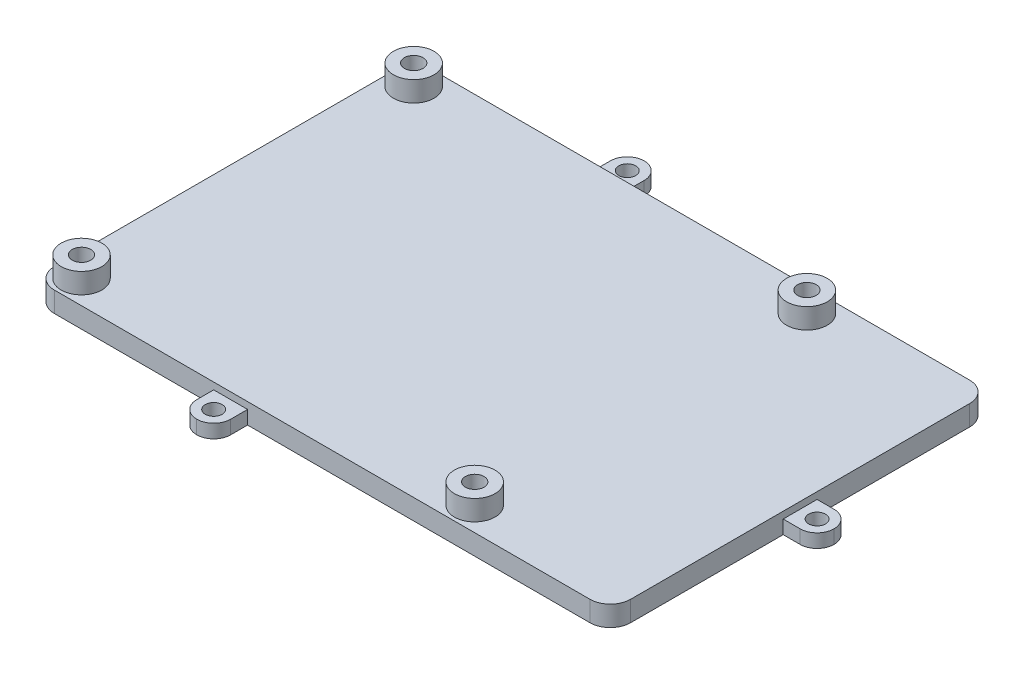
ISO-10303-21;
HEADER;
FILE_DESCRIPTION(('STEP AP214'),'2;1');
FILE_NAME('part.step','',(''),(''),'','','');
FILE_SCHEMA(('AUTOMOTIVE_DESIGN { 1 0 10303 214 1 1 1 1 }'));
ENDSEC;
DATA;
#1=APPLICATION_CONTEXT('core data for automotive mechanical design processes');
#2=APPLICATION_PROTOCOL_DEFINITION('international standard','automotive_design',2000,#1);
#3=PRODUCT_CONTEXT('',#1,'mechanical');
#4=PRODUCT('Part','Part','',(#3));
#5=PRODUCT_RELATED_PRODUCT_CATEGORY('part','',(#4));
#6=PRODUCT_DEFINITION_FORMATION('','',#4);
#7=PRODUCT_DEFINITION_CONTEXT('part definition',#1,'design');
#8=PRODUCT_DEFINITION('design','',#6,#7);
#9=PRODUCT_DEFINITION_SHAPE('','',#8);
#10=(LENGTH_UNIT() NAMED_UNIT(*) SI_UNIT(.MILLI.,.METRE.));
#11=(NAMED_UNIT(*) PLANE_ANGLE_UNIT() SI_UNIT($,.RADIAN.));
#12=(NAMED_UNIT(*) SI_UNIT($,.STERADIAN.) SOLID_ANGLE_UNIT());
#13=UNCERTAINTY_MEASURE_WITH_UNIT(LENGTH_MEASURE(1.E-05),#10,'distance_accuracy_value','');
#14=(GEOMETRIC_REPRESENTATION_CONTEXT(3) GLOBAL_UNCERTAINTY_ASSIGNED_CONTEXT((#13)) GLOBAL_UNIT_ASSIGNED_CONTEXT((#10,
#11,#12)) REPRESENTATION_CONTEXT('',''));
#15=CARTESIAN_POINT('',(0.,0.,0.));
#16=DIRECTION('',(0.,0.,1.));
#17=DIRECTION('',(1.,0.,0.));
#18=AXIS2_PLACEMENT_3D('',#15,#16,#17);
#19=CARTESIAN_POINT('',(0.,3.,0.));
#20=DIRECTION('',(0.,1.,0.));
#21=DIRECTION('',(0.,0.,1.));
#22=AXIS2_PLACEMENT_3D('',#19,#20,#21);
#23=PLANE('',#22);
#24=CARTESIAN_POINT('',(3.50000000000001,3.,-3.5));
#25=DIRECTION('',(0.,1.,0.));
#26=DIRECTION('',(0.,0.,1.));
#27=AXIS2_PLACEMENT_3D('',#24,#25,#26);
#28=CIRCLE('',#27,3.);
#29=CARTESIAN_POINT('',(3.50000000000001,3.,-0.5));
#30=VERTEX_POINT('',#29);
#31=EDGE_CURVE('E293',#30,#30,#28,.T.);
#32=ORIENTED_EDGE('',*,*,#31,.F.);
#33=EDGE_LOOP('',(#32));
#34=FACE_BOUND('',#33,.T.);
#35=CARTESIAN_POINT('',(3.50000000000001,3.,-52.5));
#36=DIRECTION('',(0.,1.,0.));
#37=DIRECTION('',(0.,0.,1.));
#38=AXIS2_PLACEMENT_3D('',#35,#36,#37);
#39=CIRCLE('',#38,3.);
#40=CARTESIAN_POINT('',(3.50000000000001,3.,-49.5));
#41=VERTEX_POINT('',#40);
#42=EDGE_CURVE('E311',#41,#41,#39,.T.);
#43=ORIENTED_EDGE('',*,*,#42,.F.);
#44=EDGE_LOOP('',(#43));
#45=FACE_BOUND('',#44,.T.);
#46=DIRECTION('',(-1.,0.,0.));
#47=VECTOR('',#46,1.);
#48=CARTESIAN_POINT('',(0.,3.,-56.));
#49=LINE('',#48,#47);
#50=CARTESIAN_POINT('',(82.,3.,-56.));
#51=VERTEX_POINT('',#50);
#52=CARTESIAN_POINT('',(3.,3.,-56.));
#53=VERTEX_POINT('',#52);
#54=EDGE_CURVE('E340',#51,#53,#49,.T.);
#55=ORIENTED_EDGE('',*,*,#54,.T.);
#56=CARTESIAN_POINT('',(3.,3.,-53.));
#57=DIRECTION('',(0.,1.,0.));
#58=DIRECTION('',(0.,0.,1.));
#59=AXIS2_PLACEMENT_3D('',#56,#57,#58);
#60=CIRCLE('',#59,3.);
#61=CARTESIAN_POINT('',(0.,3.,-53.));
#62=VERTEX_POINT('',#61);
#63=EDGE_CURVE('E376',#53,#62,#60,.T.);
#64=ORIENTED_EDGE('',*,*,#63,.T.);
#65=DIRECTION('',(0.,0.,1.));
#66=VECTOR('',#65,1.);
#67=CARTESIAN_POINT('',(0.,3.,-56.));
#68=LINE('',#67,#66);
#69=CARTESIAN_POINT('',(0.,3.,-3.));
#70=VERTEX_POINT('',#69);
#71=EDGE_CURVE('E330',#62,#70,#68,.T.);
#72=ORIENTED_EDGE('',*,*,#71,.T.);
#73=CARTESIAN_POINT('',(3.,3.,-3.));
#74=DIRECTION('',(0.,1.,0.));
#75=DIRECTION('',(0.,0.,1.));
#76=AXIS2_PLACEMENT_3D('',#73,#74,#75);
#77=CIRCLE('',#76,3.);
#78=CARTESIAN_POINT('',(3.,3.,0.));
#79=VERTEX_POINT('',#78);
#80=EDGE_CURVE('E370',#70,#79,#77,.T.);
#81=ORIENTED_EDGE('',*,*,#80,.T.);
#82=DIRECTION('',(1.,0.,0.));
#83=VECTOR('',#82,1.);
#84=CARTESIAN_POINT('',(0.,3.,0.));
#85=LINE('',#84,#83);
#86=CARTESIAN_POINT('',(82.,3.,0.));
#87=VERTEX_POINT('',#86);
#88=EDGE_CURVE('E333',#79,#87,#85,.T.);
#89=ORIENTED_EDGE('',*,*,#88,.T.);
#90=CARTESIAN_POINT('',(82.,3.,-3.));
#91=DIRECTION('',(0.,1.,0.));
#92=DIRECTION('',(0.,0.,1.));
#93=AXIS2_PLACEMENT_3D('',#90,#91,#92);
#94=CIRCLE('',#93,3.);
#95=CARTESIAN_POINT('',(85.,3.,-3.00000000000002));
#96=VERTEX_POINT('',#95);
#97=EDGE_CURVE('E372',#87,#96,#94,.T.);
#98=ORIENTED_EDGE('',*,*,#97,.T.);
#99=DIRECTION('',(0.,0.,-1.));
#100=VECTOR('',#99,1.);
#101=CARTESIAN_POINT('',(85.,3.,-56.));
#102=LINE('',#101,#100);
#103=CARTESIAN_POINT('',(85.,3.,-53.));
#104=VERTEX_POINT('',#103);
#105=EDGE_CURVE('E337',#96,#104,#102,.T.);
#106=ORIENTED_EDGE('',*,*,#105,.T.);
#107=CARTESIAN_POINT('',(82.,3.,-53.));
#108=DIRECTION('',(0.,1.,0.));
#109=DIRECTION('',(0.,0.,1.));
#110=AXIS2_PLACEMENT_3D('',#107,#108,#109);
#111=CIRCLE('',#110,3.);
#112=EDGE_CURVE('E374',#104,#51,#111,.T.);
#113=ORIENTED_EDGE('',*,*,#112,.T.);
#114=EDGE_LOOP('',(#55,#64,#72,#81,#89,#98,#106,#113));
#115=FACE_BOUND('',#114,.T.);
#116=CARTESIAN_POINT('',(61.5,3.,-52.5));
#117=DIRECTION('',(0.,1.,0.));
#118=DIRECTION('',(0.,0.,1.));
#119=AXIS2_PLACEMENT_3D('',#116,#117,#118);
#120=CIRCLE('',#119,3.00000000000001);
#121=CARTESIAN_POINT('',(61.5,3.,-49.5));
#122=VERTEX_POINT('',#121);
#123=EDGE_CURVE('E302',#122,#122,#120,.T.);
#124=ORIENTED_EDGE('',*,*,#123,.F.);
#125=EDGE_LOOP('',(#124));
#126=FACE_BOUND('',#125,.T.);
#127=CARTESIAN_POINT('',(61.5,3.,-3.5));
#128=DIRECTION('',(0.,1.,0.));
#129=DIRECTION('',(0.,0.,1.));
#130=AXIS2_PLACEMENT_3D('',#127,#128,#129);
#131=CIRCLE('',#130,3.00000000000001);
#132=CARTESIAN_POINT('',(61.5,3.,-0.499999999999992));
#133=VERTEX_POINT('',#132);
#134=EDGE_CURVE('E284',#133,#133,#131,.T.);
#135=ORIENTED_EDGE('',*,*,#134,.F.);
#136=EDGE_LOOP('',(#135));
#137=FACE_BOUND('',#136,.T.);
#138=ADVANCED_FACE('F34',(#34,#45,#115,#126,#137),#23,.T.);
#139=CARTESIAN_POINT('',(0.,0.,0.));
#140=DIRECTION('',(0.,1.,0.));
#141=DIRECTION('',(0.,0.,1.));
#142=AXIS2_PLACEMENT_3D('',#139,#140,#141);
#143=PLANE('',#142);
#144=DIRECTION('',(1.,0.,0.));
#145=VECTOR('',#144,1.);
#146=CARTESIAN_POINT('',(85.,0.,-30.5));
#147=LINE('',#146,#145);
#148=CARTESIAN_POINT('',(85.,0.,-30.5));
#149=VERTEX_POINT('',#148);
#150=CARTESIAN_POINT('',(87.5,0.,-30.5));
#151=VERTEX_POINT('',#150);
#152=EDGE_CURVE('E194',#149,#151,#147,.T.);
#153=ORIENTED_EDGE('',*,*,#152,.T.);
#154=CARTESIAN_POINT('',(87.5,0.,-28.));
#155=DIRECTION('',(0.,1.,0.));
#156=DIRECTION('',(0.,0.,1.));
#157=AXIS2_PLACEMENT_3D('',#154,#155,#156);
#158=CIRCLE('',#157,2.5);
#159=CARTESIAN_POINT('',(90.,0.,-28.));
#160=VERTEX_POINT('',#159);
#161=EDGE_CURVE('E421',#151,#160,#158,.F.);
#162=ORIENTED_EDGE('',*,*,#161,.T.);
#163=CARTESIAN_POINT('',(87.5,0.,-28.));
#164=DIRECTION('',(0.,1.,0.));
#165=DIRECTION('',(0.,0.,1.));
#166=AXIS2_PLACEMENT_3D('',#163,#164,#165);
#167=CIRCLE('',#166,2.5);
#168=CARTESIAN_POINT('',(87.5,0.,-25.5));
#169=VERTEX_POINT('',#168);
#170=EDGE_CURVE('E419',#160,#169,#167,.F.);
#171=ORIENTED_EDGE('',*,*,#170,.T.);
#172=DIRECTION('',(-1.,0.,0.));
#173=VECTOR('',#172,1.);
#174=CARTESIAN_POINT('',(85.,0.,-25.5));
#175=LINE('',#174,#173);
#176=CARTESIAN_POINT('',(85.,0.,-25.5));
#177=VERTEX_POINT('',#176);
#178=EDGE_CURVE('E219',#169,#177,#175,.T.);
#179=ORIENTED_EDGE('',*,*,#178,.T.);
#180=DIRECTION('',(0.,0.,-1.));
#181=VECTOR('',#180,1.);
#182=CARTESIAN_POINT('',(85.,0.,-56.));
#183=LINE('',#182,#181);
#184=CARTESIAN_POINT('',(85.,0.,-3.00000000000002));
#185=VERTEX_POINT('',#184);
#186=EDGE_CURVE('E199',#185,#177,#183,.T.);
#187=ORIENTED_EDGE('',*,*,#186,.F.);
#188=CARTESIAN_POINT('',(82.,0.,-3.));
#189=DIRECTION('',(0.,1.,0.));
#190=DIRECTION('',(0.,0.,1.));
#191=AXIS2_PLACEMENT_3D('',#188,#189,#190);
#192=CIRCLE('',#191,3.);
#193=CARTESIAN_POINT('',(82.,0.,0.));
#194=VERTEX_POINT('',#193);
#195=EDGE_CURVE('E358',#185,#194,#192,.F.);
#196=ORIENTED_EDGE('',*,*,#195,.T.);
#197=DIRECTION('',(1.,0.,0.));
#198=VECTOR('',#197,1.);
#199=CARTESIAN_POINT('',(0.,0.,0.));
#200=LINE('',#199,#198);
#201=CARTESIAN_POINT('',(31.5,0.,0.));
#202=VERTEX_POINT('',#201);
#203=EDGE_CURVE('E346',#202,#194,#200,.T.);
#204=ORIENTED_EDGE('',*,*,#203,.F.);
#205=DIRECTION('',(0.,0.,1.));
#206=VECTOR('',#205,1.);
#207=CARTESIAN_POINT('',(31.5,0.,0.));
#208=LINE('',#207,#206);
#209=CARTESIAN_POINT('',(31.5,0.,2.5));
#210=VERTEX_POINT('',#209);
#211=EDGE_CURVE('E267',#202,#210,#208,.T.);
#212=ORIENTED_EDGE('',*,*,#211,.T.);
#213=CARTESIAN_POINT('',(29.,0.,2.5));
#214=DIRECTION('',(0.,1.,0.));
#215=DIRECTION('',(0.,0.,1.));
#216=AXIS2_PLACEMENT_3D('',#213,#214,#215);
#217=CIRCLE('',#216,2.5);
#218=CARTESIAN_POINT('',(29.,0.,5.));
#219=VERTEX_POINT('',#218);
#220=EDGE_CURVE('E388',#210,#219,#217,.F.);
#221=ORIENTED_EDGE('',*,*,#220,.T.);
#222=CARTESIAN_POINT('',(29.,0.,2.5));
#223=DIRECTION('',(0.,1.,0.));
#224=DIRECTION('',(0.,0.,1.));
#225=AXIS2_PLACEMENT_3D('',#222,#223,#224);
#226=CIRCLE('',#225,2.5);
#227=CARTESIAN_POINT('',(26.5,0.,2.5));
#228=VERTEX_POINT('',#227);
#229=EDGE_CURVE('E390',#219,#228,#226,.F.);
#230=ORIENTED_EDGE('',*,*,#229,.T.);
#231=DIRECTION('',(0.,0.,-1.));
#232=VECTOR('',#231,1.);
#233=CARTESIAN_POINT('',(26.5,0.,0.));
#234=LINE('',#233,#232);
#235=CARTESIAN_POINT('',(26.5,0.,0.));
#236=VERTEX_POINT('',#235);
#237=EDGE_CURVE('E260',#228,#236,#234,.T.);
#238=ORIENTED_EDGE('',*,*,#237,.T.);
#239=CARTESIAN_POINT('',(3.,0.,0.));
#240=VERTEX_POINT('',#239);
#241=EDGE_CURVE('E200',#240,#236,#200,.T.);
#242=ORIENTED_EDGE('',*,*,#241,.F.);
#243=CARTESIAN_POINT('',(3.,0.,-3.));
#244=DIRECTION('',(0.,1.,0.));
#245=DIRECTION('',(0.,0.,1.));
#246=AXIS2_PLACEMENT_3D('',#243,#244,#245);
#247=CIRCLE('',#246,3.);
#248=CARTESIAN_POINT('',(0.,0.,-3.));
#249=VERTEX_POINT('',#248);
#250=EDGE_CURVE('E356',#240,#249,#247,.F.);
#251=ORIENTED_EDGE('',*,*,#250,.T.);
#252=DIRECTION('',(0.,0.,1.));
#253=VECTOR('',#252,1.);
#254=CARTESIAN_POINT('',(0.,0.,-56.));
#255=LINE('',#254,#253);
#256=CARTESIAN_POINT('',(0.,0.,-53.));
#257=VERTEX_POINT('',#256);
#258=EDGE_CURVE('E329',#257,#249,#255,.T.);
#259=ORIENTED_EDGE('',*,*,#258,.F.);
#260=CARTESIAN_POINT('',(3.,0.,-53.));
#261=DIRECTION('',(0.,1.,0.));
#262=DIRECTION('',(0.,0.,1.));
#263=AXIS2_PLACEMENT_3D('',#260,#261,#262);
#264=CIRCLE('',#263,3.);
#265=CARTESIAN_POINT('',(3.,0.,-56.));
#266=VERTEX_POINT('',#265);
#267=EDGE_CURVE('E362',#257,#266,#264,.F.);
#268=ORIENTED_EDGE('',*,*,#267,.T.);
#269=DIRECTION('',(-1.,0.,0.));
#270=VECTOR('',#269,1.);
#271=CARTESIAN_POINT('',(0.,0.,-56.));
#272=LINE('',#271,#270);
#273=CARTESIAN_POINT('',(26.5,0.,-56.));
#274=VERTEX_POINT('',#273);
#275=EDGE_CURVE('E349',#274,#266,#272,.T.);
#276=ORIENTED_EDGE('',*,*,#275,.F.);
#277=DIRECTION('',(0.,0.,-1.));
#278=VECTOR('',#277,1.);
#279=CARTESIAN_POINT('',(26.5,0.,-56.));
#280=LINE('',#279,#278);
#281=CARTESIAN_POINT('',(26.5,0.,-58.5));
#282=VERTEX_POINT('',#281);
#283=EDGE_CURVE('E235',#274,#282,#280,.T.);
#284=ORIENTED_EDGE('',*,*,#283,.T.);
#285=CARTESIAN_POINT('',(29.,0.,-58.5));
#286=DIRECTION('',(0.,1.,0.));
#287=DIRECTION('',(0.,0.,1.));
#288=AXIS2_PLACEMENT_3D('',#285,#286,#287);
#289=CIRCLE('',#288,2.5);
#290=CARTESIAN_POINT('',(29.,0.,-61.));
#291=VERTEX_POINT('',#290);
#292=EDGE_CURVE('E401',#282,#291,#289,.F.);
#293=ORIENTED_EDGE('',*,*,#292,.T.);
#294=CARTESIAN_POINT('',(29.,0.,-58.5));
#295=DIRECTION('',(0.,1.,0.));
#296=DIRECTION('',(0.,0.,1.));
#297=AXIS2_PLACEMENT_3D('',#294,#295,#296);
#298=CIRCLE('',#297,2.5);
#299=CARTESIAN_POINT('',(31.5,0.,-58.5));
#300=VERTEX_POINT('',#299);
#301=EDGE_CURVE('E405',#291,#300,#298,.F.);
#302=ORIENTED_EDGE('',*,*,#301,.T.);
#303=DIRECTION('',(0.,0.,1.));
#304=VECTOR('',#303,1.);
#305=CARTESIAN_POINT('',(31.5,0.,-56.));
#306=LINE('',#305,#304);
#307=CARTESIAN_POINT('',(31.5,0.,-56.));
#308=VERTEX_POINT('',#307);
#309=EDGE_CURVE('E243',#300,#308,#306,.T.);
#310=ORIENTED_EDGE('',*,*,#309,.T.);
#311=CARTESIAN_POINT('',(82.,0.,-56.));
#312=VERTEX_POINT('',#311);
#313=EDGE_CURVE('E334',#312,#308,#272,.T.);
#314=ORIENTED_EDGE('',*,*,#313,.F.);
#315=CARTESIAN_POINT('',(82.,0.,-53.));
#316=DIRECTION('',(0.,1.,0.));
#317=DIRECTION('',(0.,0.,1.));
#318=AXIS2_PLACEMENT_3D('',#315,#316,#317);
#319=CIRCLE('',#318,3.);
#320=CARTESIAN_POINT('',(85.,0.,-53.));
#321=VERTEX_POINT('',#320);
#322=EDGE_CURVE('E196',#312,#321,#319,.F.);
#323=ORIENTED_EDGE('',*,*,#322,.T.);
#324=EDGE_CURVE('E189',#149,#321,#183,.T.);
#325=ORIENTED_EDGE('',*,*,#324,.F.);
#326=EDGE_LOOP('',(#153,#162,#171,#179,#187,#196,#204,#212,#221,#230,#238,#242,#251,#259,#268,
#276,#284,#293,#302,#310,#314,#323,#325));
#327=FACE_BOUND('',#326,.T.);
#328=CARTESIAN_POINT('',(61.5,0.,-52.5));
#329=DIRECTION('',(0.,1.,0.));
#330=DIRECTION('',(0.,0.,1.));
#331=AXIS2_PLACEMENT_3D('',#328,#329,#330);
#332=CIRCLE('',#331,1.375);
#333=CARTESIAN_POINT('',(61.5,0.,-51.125));
#334=VERTEX_POINT('',#333);
#335=EDGE_CURVE('E326',#334,#334,#332,.T.);
#336=ORIENTED_EDGE('',*,*,#335,.T.);
#337=EDGE_LOOP('',(#336));
#338=FACE_BOUND('',#337,.T.);
#339=CARTESIAN_POINT('',(3.50000000000001,0.,-52.5));
#340=DIRECTION('',(0.,1.,0.));
#341=DIRECTION('',(0.,0.,1.));
#342=AXIS2_PLACEMENT_3D('',#339,#340,#341);
#343=CIRCLE('',#342,1.375);
#344=CARTESIAN_POINT('',(3.50000000000001,0.,-51.125));
#345=VERTEX_POINT('',#344);
#346=EDGE_CURVE('E323',#345,#345,#343,.T.);
#347=ORIENTED_EDGE('',*,*,#346,.T.);
#348=EDGE_LOOP('',(#347));
#349=FACE_BOUND('',#348,.T.);
#350=CARTESIAN_POINT('',(3.50000000000001,0.,-3.5));
#351=DIRECTION('',(0.,1.,0.));
#352=DIRECTION('',(0.,0.,1.));
#353=AXIS2_PLACEMENT_3D('',#350,#351,#352);
#354=CIRCLE('',#353,1.375);
#355=CARTESIAN_POINT('',(3.50000000000001,0.,-2.125));
#356=VERTEX_POINT('',#355);
#357=EDGE_CURVE('E320',#356,#356,#354,.T.);
#358=ORIENTED_EDGE('',*,*,#357,.T.);
#359=EDGE_LOOP('',(#358));
#360=FACE_BOUND('',#359,.T.);
#361=CARTESIAN_POINT('',(61.5,0.,-3.5));
#362=DIRECTION('',(0.,1.,0.));
#363=DIRECTION('',(0.,0.,1.));
#364=AXIS2_PLACEMENT_3D('',#361,#362,#363);
#365=CIRCLE('',#364,1.375);
#366=CARTESIAN_POINT('',(61.5,0.,-2.125));
#367=VERTEX_POINT('',#366);
#368=EDGE_CURVE('E315',#367,#367,#365,.T.);
#369=ORIENTED_EDGE('',*,*,#368,.T.);
#370=EDGE_LOOP('',(#369));
#371=FACE_BOUND('',#370,.T.);
#372=CARTESIAN_POINT('',(29.,0.,2.5));
#373=DIRECTION('',(0.,-1.,0.));
#374=DIRECTION('',(0.,0.,-1.));
#375=AXIS2_PLACEMENT_3D('',#372,#373,#374);
#376=CIRCLE('',#375,1.25);
#377=CARTESIAN_POINT('',(29.,0.,1.25));
#378=VERTEX_POINT('',#377);
#379=EDGE_CURVE('E261',#378,#378,#376,.T.);
#380=ORIENTED_EDGE('',*,*,#379,.F.);
#381=EDGE_LOOP('',(#380));
#382=FACE_BOUND('',#381,.T.);
#383=CARTESIAN_POINT('',(29.,0.,-58.5));
#384=DIRECTION('',(0.,-1.,0.));
#385=DIRECTION('',(0.,0.,-1.));
#386=AXIS2_PLACEMENT_3D('',#383,#384,#385);
#387=CIRCLE('',#386,1.25);
#388=CARTESIAN_POINT('',(29.,0.,-59.75));
#389=VERTEX_POINT('',#388);
#390=EDGE_CURVE('E236',#389,#389,#387,.T.);
#391=ORIENTED_EDGE('',*,*,#390,.F.);
#392=EDGE_LOOP('',(#391));
#393=FACE_BOUND('',#392,.T.);
#394=CARTESIAN_POINT('',(87.5,0.,-28.));
#395=DIRECTION('',(0.,-1.,0.));
#396=DIRECTION('',(0.,0.,-1.));
#397=AXIS2_PLACEMENT_3D('',#394,#395,#396);
#398=CIRCLE('',#397,1.25);
#399=CARTESIAN_POINT('',(87.5,0.,-29.25));
#400=VERTEX_POINT('',#399);
#401=EDGE_CURVE('E224',#400,#400,#398,.T.);
#402=ORIENTED_EDGE('',*,*,#401,.F.);
#403=EDGE_LOOP('',(#402));
#404=FACE_BOUND('',#403,.T.);
#405=ADVANCED_FACE('F191',(#327,#338,#349,#360,#371,#382,#393,#404),#143,.F.);
#406=CARTESIAN_POINT('',(0.,3.,-56.));
#407=DIRECTION('',(1.,0.,0.));
#408=DIRECTION('',(0.,0.,-1.));
#409=AXIS2_PLACEMENT_3D('',#406,#407,#408);
#410=PLANE('',#409);
#411=ORIENTED_EDGE('',*,*,#71,.F.);
#412=DIRECTION('',(0.,-1.,0.));
#413=VECTOR('',#412,1.);
#414=CARTESIAN_POINT('',(0.,3.,-53.));
#415=LINE('',#414,#413);
#416=EDGE_CURVE('E353',#62,#257,#415,.T.);
#417=ORIENTED_EDGE('',*,*,#416,.T.);
#418=ORIENTED_EDGE('',*,*,#258,.T.);
#419=DIRECTION('',(0.,-1.,0.));
#420=VECTOR('',#419,1.);
#421=CARTESIAN_POINT('',(0.,3.,-3.));
#422=LINE('',#421,#420);
#423=EDGE_CURVE('E343',#249,#70,#422,.F.);
#424=ORIENTED_EDGE('',*,*,#423,.T.);
#425=EDGE_LOOP('',(#411,#417,#418,#424));
#426=FACE_BOUND('',#425,.T.);
#427=ADVANCED_FACE('F440',(#426),#410,.F.);
#428=CARTESIAN_POINT('',(0.,3.,0.));
#429=DIRECTION('',(0.,0.,-1.));
#430=DIRECTION('',(-1.,0.,0.));
#431=AXIS2_PLACEMENT_3D('',#428,#429,#430);
#432=PLANE('',#431);
#433=ORIENTED_EDGE('',*,*,#241,.T.);
#434=DIRECTION('',(0.,-1.,0.));
#435=VECTOR('',#434,1.);
#436=CARTESIAN_POINT('',(26.5,2.,0.));
#437=LINE('',#436,#435);
#438=CARTESIAN_POINT('',(26.5,2.,0.));
#439=VERTEX_POINT('',#438);
#440=EDGE_CURVE('E272',#439,#236,#437,.T.);
#441=ORIENTED_EDGE('',*,*,#440,.F.);
#442=DIRECTION('',(1.,0.,0.));
#443=VECTOR('',#442,1.);
#444=CARTESIAN_POINT('',(26.5,2.,0.));
#445=LINE('',#444,#443);
#446=CARTESIAN_POINT('',(31.5,2.,0.));
#447=VERTEX_POINT('',#446);
#448=EDGE_CURVE('E266',#439,#447,#445,.T.);
#449=ORIENTED_EDGE('',*,*,#448,.T.);
#450=DIRECTION('',(0.,-1.,0.));
#451=VECTOR('',#450,1.);
#452=CARTESIAN_POINT('',(31.5,2.,0.));
#453=LINE('',#452,#451);
#454=EDGE_CURVE('E276',#447,#202,#453,.T.);
#455=ORIENTED_EDGE('',*,*,#454,.T.);
#456=ORIENTED_EDGE('',*,*,#203,.T.);
#457=DIRECTION('',(0.,-1.,0.));
#458=VECTOR('',#457,1.);
#459=CARTESIAN_POINT('',(82.,3.,0.));
#460=LINE('',#459,#458);
#461=EDGE_CURVE('E386',#194,#87,#460,.F.);
#462=ORIENTED_EDGE('',*,*,#461,.T.);
#463=ORIENTED_EDGE('',*,*,#88,.F.);
#464=DIRECTION('',(0.,-1.,0.));
#465=VECTOR('',#464,1.);
#466=CARTESIAN_POINT('',(3.,3.,0.));
#467=LINE('',#466,#465);
#468=EDGE_CURVE('E383',#79,#240,#467,.T.);
#469=ORIENTED_EDGE('',*,*,#468,.T.);
#470=EDGE_LOOP('',(#433,#441,#449,#455,#456,#462,#463,#469));
#471=FACE_BOUND('',#470,.T.);
#472=ADVANCED_FACE('F446',(#471),#432,.F.);
#473=CARTESIAN_POINT('',(85.,3.,-56.));
#474=DIRECTION('',(-1.,0.,0.));
#475=DIRECTION('',(0.,0.,1.));
#476=AXIS2_PLACEMENT_3D('',#473,#474,#475);
#477=PLANE('',#476);
#478=ORIENTED_EDGE('',*,*,#186,.T.);
#479=DIRECTION('',(0.,-1.,0.));
#480=VECTOR('',#479,1.);
#481=CARTESIAN_POINT('',(85.,2.,-25.5));
#482=LINE('',#481,#480);
#483=CARTESIAN_POINT('',(85.,2.,-25.5));
#484=VERTEX_POINT('',#483);
#485=EDGE_CURVE('E212',#484,#177,#482,.T.);
#486=ORIENTED_EDGE('',*,*,#485,.F.);
#487=DIRECTION('',(0.,0.,-1.));
#488=VECTOR('',#487,1.);
#489=CARTESIAN_POINT('',(85.,2.,-25.5));
#490=LINE('',#489,#488);
#491=CARTESIAN_POINT('',(85.,2.,-30.5));
#492=VERTEX_POINT('',#491);
#493=EDGE_CURVE('E208',#484,#492,#490,.T.);
#494=ORIENTED_EDGE('',*,*,#493,.T.);
#495=DIRECTION('',(0.,-1.,0.));
#496=VECTOR('',#495,1.);
#497=CARTESIAN_POINT('',(85.,2.,-30.5));
#498=LINE('',#497,#496);
#499=EDGE_CURVE('E203',#492,#149,#498,.T.);
#500=ORIENTED_EDGE('',*,*,#499,.T.);
#501=ORIENTED_EDGE('',*,*,#324,.T.);
#502=DIRECTION('',(0.,-1.,0.));
#503=VECTOR('',#502,1.);
#504=CARTESIAN_POINT('',(85.,3.,-53.));
#505=LINE('',#504,#503);
#506=EDGE_CURVE('E381',#321,#104,#505,.F.);
#507=ORIENTED_EDGE('',*,*,#506,.T.);
#508=ORIENTED_EDGE('',*,*,#105,.F.);
#509=DIRECTION('',(0.,-1.,0.));
#510=VECTOR('',#509,1.);
#511=CARTESIAN_POINT('',(85.,3.,-3.));
#512=LINE('',#511,#510);
#513=EDGE_CURVE('E378',#96,#185,#512,.T.);
#514=ORIENTED_EDGE('',*,*,#513,.T.);
#515=EDGE_LOOP('',(#478,#486,#494,#500,#501,#507,#508,#514));
#516=FACE_BOUND('',#515,.T.);
#517=ADVANCED_FACE('F205',(#516),#477,.F.);
#518=CARTESIAN_POINT('',(0.,3.,-56.));
#519=DIRECTION('',(0.,0.,1.));
#520=DIRECTION('',(1.,0.,0.));
#521=AXIS2_PLACEMENT_3D('',#518,#519,#520);
#522=PLANE('',#521);
#523=DIRECTION('',(-1.,0.,0.));
#524=VECTOR('',#523,1.);
#525=CARTESIAN_POINT('',(26.5,2.,-56.));
#526=LINE('',#525,#524);
#527=CARTESIAN_POINT('',(31.5,2.,-56.));
#528=VERTEX_POINT('',#527);
#529=CARTESIAN_POINT('',(26.5,2.,-56.));
#530=VERTEX_POINT('',#529);
#531=EDGE_CURVE('E245',#528,#530,#526,.T.);
#532=ORIENTED_EDGE('',*,*,#531,.T.);
#533=DIRECTION('',(0.,-1.,0.));
#534=VECTOR('',#533,1.);
#535=CARTESIAN_POINT('',(26.5,2.,-56.));
#536=LINE('',#535,#534);
#537=EDGE_CURVE('E251',#530,#274,#536,.T.);
#538=ORIENTED_EDGE('',*,*,#537,.T.);
#539=ORIENTED_EDGE('',*,*,#275,.T.);
#540=DIRECTION('',(0.,-1.,0.));
#541=VECTOR('',#540,1.);
#542=CARTESIAN_POINT('',(3.,3.,-56.));
#543=LINE('',#542,#541);
#544=EDGE_CURVE('E368',#266,#53,#543,.F.);
#545=ORIENTED_EDGE('',*,*,#544,.T.);
#546=ORIENTED_EDGE('',*,*,#54,.F.);
#547=DIRECTION('',(0.,-1.,0.));
#548=VECTOR('',#547,1.);
#549=CARTESIAN_POINT('',(82.,3.,-56.));
#550=LINE('',#549,#548);
#551=EDGE_CURVE('E365',#51,#312,#550,.T.);
#552=ORIENTED_EDGE('',*,*,#551,.T.);
#553=ORIENTED_EDGE('',*,*,#313,.T.);
#554=DIRECTION('',(0.,-1.,0.));
#555=VECTOR('',#554,1.);
#556=CARTESIAN_POINT('',(31.5,2.,-56.));
#557=LINE('',#556,#555);
#558=EDGE_CURVE('E247',#528,#308,#557,.T.);
#559=ORIENTED_EDGE('',*,*,#558,.F.);
#560=EDGE_LOOP('',(#532,#538,#539,#545,#546,#552,#553,#559));
#561=FACE_BOUND('',#560,.T.);
#562=ADVANCED_FACE('F453',(#561),#522,.F.);
#563=CARTESIAN_POINT('',(61.5,3.,-52.5));
#564=DIRECTION('',(0.,-1.,0.));
#565=DIRECTION('',(0.,0.,-1.));
#566=AXIS2_PLACEMENT_3D('',#563,#564,#565);
#567=CYLINDRICAL_SURFACE('',#566,1.375);
#568=ORIENTED_EDGE('',*,*,#335,.F.);
#569=EDGE_LOOP('',(#568));
#570=FACE_BOUND('',#569,.T.);
#571=CARTESIAN_POINT('',(61.5,6.,-52.5));
#572=DIRECTION('',(0.,1.,0.));
#573=DIRECTION('',(0.,0.,1.));
#574=AXIS2_PLACEMENT_3D('',#571,#572,#573);
#575=CIRCLE('',#574,1.375);
#576=CARTESIAN_POINT('',(61.5,6.,-51.125));
#577=VERTEX_POINT('',#576);
#578=EDGE_CURVE('E297',#577,#577,#575,.T.);
#579=ORIENTED_EDGE('',*,*,#578,.T.);
#580=EDGE_LOOP('',(#579));
#581=FACE_BOUND('',#580,.T.);
#582=ADVANCED_FACE('F456',(#570,#581),#567,.F.);
#583=CARTESIAN_POINT('',(3.50000000000001,3.,-52.5));
#584=DIRECTION('',(0.,-1.,0.));
#585=DIRECTION('',(0.,0.,-1.));
#586=AXIS2_PLACEMENT_3D('',#583,#584,#585);
#587=CYLINDRICAL_SURFACE('',#586,1.375);
#588=ORIENTED_EDGE('',*,*,#346,.F.);
#589=EDGE_LOOP('',(#588));
#590=FACE_BOUND('',#589,.T.);
#591=CARTESIAN_POINT('',(3.50000000000001,6.,-52.5));
#592=DIRECTION('',(0.,1.,0.));
#593=DIRECTION('',(0.,0.,1.));
#594=AXIS2_PLACEMENT_3D('',#591,#592,#593);
#595=CIRCLE('',#594,1.375);
#596=CARTESIAN_POINT('',(3.50000000000001,6.,-51.125));
#597=VERTEX_POINT('',#596);
#598=EDGE_CURVE('E306',#597,#597,#595,.T.);
#599=ORIENTED_EDGE('',*,*,#598,.T.);
#600=EDGE_LOOP('',(#599));
#601=FACE_BOUND('',#600,.T.);
#602=ADVANCED_FACE('F586',(#590,#601),#587,.F.);
#603=CARTESIAN_POINT('',(3.50000000000001,3.,-3.5));
#604=DIRECTION('',(0.,-1.,0.));
#605=DIRECTION('',(0.,0.,-1.));
#606=AXIS2_PLACEMENT_3D('',#603,#604,#605);
#607=CYLINDRICAL_SURFACE('',#606,1.375);
#608=ORIENTED_EDGE('',*,*,#357,.F.);
#609=EDGE_LOOP('',(#608));
#610=FACE_BOUND('',#609,.T.);
#611=CARTESIAN_POINT('',(3.50000000000001,6.,-3.5));
#612=DIRECTION('',(0.,1.,0.));
#613=DIRECTION('',(0.,0.,1.));
#614=AXIS2_PLACEMENT_3D('',#611,#612,#613);
#615=CIRCLE('',#614,1.375);
#616=CARTESIAN_POINT('',(3.50000000000001,6.,-2.125));
#617=VERTEX_POINT('',#616);
#618=EDGE_CURVE('E288',#617,#617,#615,.T.);
#619=ORIENTED_EDGE('',*,*,#618,.T.);
#620=EDGE_LOOP('',(#619));
#621=FACE_BOUND('',#620,.T.);
#622=ADVANCED_FACE('F582',(#610,#621),#607,.F.);
#623=CARTESIAN_POINT('',(61.5,3.,-3.5));
#624=DIRECTION('',(0.,-1.,0.));
#625=DIRECTION('',(0.,0.,-1.));
#626=AXIS2_PLACEMENT_3D('',#623,#624,#625);
#627=CYLINDRICAL_SURFACE('',#626,1.375);
#628=ORIENTED_EDGE('',*,*,#368,.F.);
#629=EDGE_LOOP('',(#628));
#630=FACE_BOUND('',#629,.T.);
#631=CARTESIAN_POINT('',(61.5,6.,-3.5));
#632=DIRECTION('',(0.,1.,0.));
#633=DIRECTION('',(0.,0.,1.));
#634=AXIS2_PLACEMENT_3D('',#631,#632,#633);
#635=CIRCLE('',#634,1.375);
#636=CARTESIAN_POINT('',(61.5,6.,-2.125));
#637=VERTEX_POINT('',#636);
#638=EDGE_CURVE('E279',#637,#637,#635,.T.);
#639=ORIENTED_EDGE('',*,*,#638,.T.);
#640=EDGE_LOOP('',(#639));
#641=FACE_BOUND('',#640,.T.);
#642=ADVANCED_FACE('F467',(#630,#641),#627,.F.);
#643=CARTESIAN_POINT('',(3.,3.,-53.));
#644=DIRECTION('',(0.,-1.,0.));
#645=DIRECTION('',(0.,0.,-1.));
#646=AXIS2_PLACEMENT_3D('',#643,#644,#645);
#647=CYLINDRICAL_SURFACE('',#646,3.);
#648=ORIENTED_EDGE('',*,*,#63,.F.);
#649=ORIENTED_EDGE('',*,*,#544,.F.);
#650=ORIENTED_EDGE('',*,*,#267,.F.);
#651=ORIENTED_EDGE('',*,*,#416,.F.);
#652=EDGE_LOOP('',(#648,#649,#650,#651));
#653=FACE_BOUND('',#652,.T.);
#654=ADVANCED_FACE('F463',(#653),#647,.T.);
#655=CARTESIAN_POINT('',(82.,3.,-53.));
#656=DIRECTION('',(0.,-1.,0.));
#657=DIRECTION('',(0.,0.,-1.));
#658=AXIS2_PLACEMENT_3D('',#655,#656,#657);
#659=CYLINDRICAL_SURFACE('',#658,3.);
#660=ORIENTED_EDGE('',*,*,#112,.F.);
#661=ORIENTED_EDGE('',*,*,#506,.F.);
#662=ORIENTED_EDGE('',*,*,#322,.F.);
#663=ORIENTED_EDGE('',*,*,#551,.F.);
#664=EDGE_LOOP('',(#660,#661,#662,#663));
#665=FACE_BOUND('',#664,.T.);
#666=ADVANCED_FACE('F466',(#665),#659,.T.);
#667=CARTESIAN_POINT('',(82.,3.,-3.));
#668=DIRECTION('',(0.,-1.,0.));
#669=DIRECTION('',(0.,0.,-1.));
#670=AXIS2_PLACEMENT_3D('',#667,#668,#669);
#671=CYLINDRICAL_SURFACE('',#670,3.);
#672=ORIENTED_EDGE('',*,*,#97,.F.);
#673=ORIENTED_EDGE('',*,*,#461,.F.);
#674=ORIENTED_EDGE('',*,*,#195,.F.);
#675=ORIENTED_EDGE('',*,*,#513,.F.);
#676=EDGE_LOOP('',(#672,#673,#674,#675));
#677=FACE_BOUND('',#676,.T.);
#678=ADVANCED_FACE('F471',(#677),#671,.T.);
#679=CARTESIAN_POINT('',(3.,3.,-3.));
#680=DIRECTION('',(0.,-1.,0.));
#681=DIRECTION('',(0.,0.,-1.));
#682=AXIS2_PLACEMENT_3D('',#679,#680,#681);
#683=CYLINDRICAL_SURFACE('',#682,3.);
#684=ORIENTED_EDGE('',*,*,#80,.F.);
#685=ORIENTED_EDGE('',*,*,#423,.F.);
#686=ORIENTED_EDGE('',*,*,#250,.F.);
#687=ORIENTED_EDGE('',*,*,#468,.F.);
#688=EDGE_LOOP('',(#684,#685,#686,#687));
#689=FACE_BOUND('',#688,.T.);
#690=ADVANCED_FACE('F475',(#689),#683,.T.);
#691=CARTESIAN_POINT('',(3.50000000000001,6.,-52.5));
#692=DIRECTION('',(0.,1.,0.));
#693=DIRECTION('',(0.,0.,1.));
#694=AXIS2_PLACEMENT_3D('',#691,#692,#693);
#695=PLANE('',#694);
#696=CARTESIAN_POINT('',(3.50000000000001,6.,-52.5));
#697=DIRECTION('',(0.,1.,0.));
#698=DIRECTION('',(0.,0.,1.));
#699=AXIS2_PLACEMENT_3D('',#696,#697,#698);
#700=CIRCLE('',#699,3.);
#701=CARTESIAN_POINT('',(3.50000000000001,6.,-49.5));
#702=VERTEX_POINT('',#701);
#703=EDGE_CURVE('E312',#702,#702,#700,.T.);
#704=ORIENTED_EDGE('',*,*,#703,.T.);
#705=EDGE_LOOP('',(#704));
#706=FACE_BOUND('',#705,.T.);
#707=ORIENTED_EDGE('',*,*,#598,.F.);
#708=EDGE_LOOP('',(#707));
#709=FACE_BOUND('',#708,.T.);
#710=ADVANCED_FACE('F479',(#706,#709),#695,.T.);
#711=CARTESIAN_POINT('',(3.50000000000001,6.,-52.5));
#712=DIRECTION('',(0.,-1.,0.));
#713=DIRECTION('',(0.,0.,-1.));
#714=AXIS2_PLACEMENT_3D('',#711,#712,#713);
#715=CYLINDRICAL_SURFACE('',#714,3.);
#716=ORIENTED_EDGE('',*,*,#703,.F.);
#717=EDGE_LOOP('',(#716));
#718=FACE_BOUND('',#717,.T.);
#719=ORIENTED_EDGE('',*,*,#42,.T.);
#720=EDGE_LOOP('',(#719));
#721=FACE_BOUND('',#720,.T.);
#722=ADVANCED_FACE('F569',(#718,#721),#715,.T.);
#723=CARTESIAN_POINT('',(61.5,6.,-52.5));
#724=DIRECTION('',(0.,1.,0.));
#725=DIRECTION('',(0.,0.,1.));
#726=AXIS2_PLACEMENT_3D('',#723,#724,#725);
#727=PLANE('',#726);
#728=CARTESIAN_POINT('',(61.5,6.,-52.5));
#729=DIRECTION('',(0.,1.,0.));
#730=DIRECTION('',(0.,0.,1.));
#731=AXIS2_PLACEMENT_3D('',#728,#729,#730);
#732=CIRCLE('',#731,3.00000000000001);
#733=CARTESIAN_POINT('',(61.5,6.,-49.5));
#734=VERTEX_POINT('',#733);
#735=EDGE_CURVE('E303',#734,#734,#732,.T.);
#736=ORIENTED_EDGE('',*,*,#735,.T.);
#737=EDGE_LOOP('',(#736));
#738=FACE_BOUND('',#737,.T.);
#739=ORIENTED_EDGE('',*,*,#578,.F.);
#740=EDGE_LOOP('',(#739));
#741=FACE_BOUND('',#740,.T.);
#742=ADVANCED_FACE('F566',(#738,#741),#727,.T.);
#743=CARTESIAN_POINT('',(61.5,6.,-52.5));
#744=DIRECTION('',(0.,-1.,0.));
#745=DIRECTION('',(0.,0.,-1.));
#746=AXIS2_PLACEMENT_3D('',#743,#744,#745);
#747=CYLINDRICAL_SURFACE('',#746,3.00000000000001);
#748=ORIENTED_EDGE('',*,*,#735,.F.);
#749=EDGE_LOOP('',(#748));
#750=FACE_BOUND('',#749,.T.);
#751=ORIENTED_EDGE('',*,*,#123,.T.);
#752=EDGE_LOOP('',(#751));
#753=FACE_BOUND('',#752,.T.);
#754=ADVANCED_FACE('F561',(#750,#753),#747,.T.);
#755=CARTESIAN_POINT('',(3.50000000000001,6.,-3.5));
#756=DIRECTION('',(0.,1.,0.));
#757=DIRECTION('',(0.,0.,1.));
#758=AXIS2_PLACEMENT_3D('',#755,#756,#757);
#759=PLANE('',#758);
#760=CARTESIAN_POINT('',(3.50000000000001,6.,-3.5));
#761=DIRECTION('',(0.,1.,0.));
#762=DIRECTION('',(0.,0.,1.));
#763=AXIS2_PLACEMENT_3D('',#760,#761,#762);
#764=CIRCLE('',#763,3.);
#765=CARTESIAN_POINT('',(3.50000000000001,6.,-0.5));
#766=VERTEX_POINT('',#765);
#767=EDGE_CURVE('E294',#766,#766,#764,.T.);
#768=ORIENTED_EDGE('',*,*,#767,.T.);
#769=EDGE_LOOP('',(#768));
#770=FACE_BOUND('',#769,.T.);
#771=ORIENTED_EDGE('',*,*,#618,.F.);
#772=EDGE_LOOP('',(#771));
#773=FACE_BOUND('',#772,.T.);
#774=ADVANCED_FACE('F558',(#770,#773),#759,.T.);
#775=CARTESIAN_POINT('',(3.50000000000001,6.,-3.5));
#776=DIRECTION('',(0.,-1.,0.));
#777=DIRECTION('',(0.,0.,-1.));
#778=AXIS2_PLACEMENT_3D('',#775,#776,#777);
#779=CYLINDRICAL_SURFACE('',#778,3.);
#780=ORIENTED_EDGE('',*,*,#767,.F.);
#781=EDGE_LOOP('',(#780));
#782=FACE_BOUND('',#781,.T.);
#783=ORIENTED_EDGE('',*,*,#31,.T.);
#784=EDGE_LOOP('',(#783));
#785=FACE_BOUND('',#784,.T.);
#786=ADVANCED_FACE('F553',(#782,#785),#779,.T.);
#787=CARTESIAN_POINT('',(61.5,6.,-3.5));
#788=DIRECTION('',(0.,1.,0.));
#789=DIRECTION('',(0.,0.,1.));
#790=AXIS2_PLACEMENT_3D('',#787,#788,#789);
#791=PLANE('',#790);
#792=CARTESIAN_POINT('',(61.5,6.,-3.5));
#793=DIRECTION('',(0.,1.,0.));
#794=DIRECTION('',(0.,0.,1.));
#795=AXIS2_PLACEMENT_3D('',#792,#793,#794);
#796=CIRCLE('',#795,3.00000000000001);
#797=CARTESIAN_POINT('',(61.5,6.,-0.499999999999992));
#798=VERTEX_POINT('',#797);
#799=EDGE_CURVE('E285',#798,#798,#796,.T.);
#800=ORIENTED_EDGE('',*,*,#799,.T.);
#801=EDGE_LOOP('',(#800));
#802=FACE_BOUND('',#801,.T.);
#803=ORIENTED_EDGE('',*,*,#638,.F.);
#804=EDGE_LOOP('',(#803));
#805=FACE_BOUND('',#804,.T.);
#806=ADVANCED_FACE('F550',(#802,#805),#791,.T.);
#807=CARTESIAN_POINT('',(61.5,6.,-3.5));
#808=DIRECTION('',(0.,-1.,0.));
#809=DIRECTION('',(0.,0.,-1.));
#810=AXIS2_PLACEMENT_3D('',#807,#808,#809);
#811=CYLINDRICAL_SURFACE('',#810,3.00000000000001);
#812=ORIENTED_EDGE('',*,*,#799,.F.);
#813=EDGE_LOOP('',(#812));
#814=FACE_BOUND('',#813,.T.);
#815=ORIENTED_EDGE('',*,*,#134,.T.);
#816=EDGE_LOOP('',(#815));
#817=FACE_BOUND('',#816,.T.);
#818=ADVANCED_FACE('F548',(#814,#817),#811,.T.);
#819=CARTESIAN_POINT('',(26.5,2.,0.));
#820=DIRECTION('',(-1.,0.,0.));
#821=DIRECTION('',(0.,0.,1.));
#822=AXIS2_PLACEMENT_3D('',#819,#820,#821);
#823=PLANE('',#822);
#824=ORIENTED_EDGE('',*,*,#237,.F.);
#825=DIRECTION('',(0.,-1.,0.));
#826=VECTOR('',#825,1.);
#827=CARTESIAN_POINT('',(26.5,2.,2.5));
#828=LINE('',#827,#826);
#829=CARTESIAN_POINT('',(26.5,2.,2.5));
#830=VERTEX_POINT('',#829);
#831=EDGE_CURVE('E392',#228,#830,#828,.F.);
#832=ORIENTED_EDGE('',*,*,#831,.T.);
#833=DIRECTION('',(0.,0.,-1.));
#834=VECTOR('',#833,1.);
#835=CARTESIAN_POINT('',(26.5,2.,0.));
#836=LINE('',#835,#834);
#837=EDGE_CURVE('E264',#830,#439,#836,.T.);
#838=ORIENTED_EDGE('',*,*,#837,.T.);
#839=ORIENTED_EDGE('',*,*,#440,.T.);
#840=EDGE_LOOP('',(#824,#832,#838,#839));
#841=FACE_BOUND('',#840,.T.);
#842=ADVANCED_FACE('F544',(#841),#823,.T.);
#843=CARTESIAN_POINT('',(31.5,2.,0.));
#844=DIRECTION('',(1.,0.,0.));
#845=DIRECTION('',(0.,0.,-1.));
#846=AXIS2_PLACEMENT_3D('',#843,#844,#845);
#847=PLANE('',#846);
#848=DIRECTION('',(0.,0.,1.));
#849=VECTOR('',#848,1.);
#850=CARTESIAN_POINT('',(31.5,2.,0.));
#851=LINE('',#850,#849);
#852=CARTESIAN_POINT('',(31.5,2.,2.5));
#853=VERTEX_POINT('',#852);
#854=EDGE_CURVE('E269',#447,#853,#851,.T.);
#855=ORIENTED_EDGE('',*,*,#854,.T.);
#856=DIRECTION('',(0.,-1.,0.));
#857=VECTOR('',#856,1.);
#858=CARTESIAN_POINT('',(31.5,2.,2.5));
#859=LINE('',#858,#857);
#860=EDGE_CURVE('E399',#853,#210,#859,.T.);
#861=ORIENTED_EDGE('',*,*,#860,.T.);
#862=ORIENTED_EDGE('',*,*,#211,.F.);
#863=ORIENTED_EDGE('',*,*,#454,.F.);
#864=EDGE_LOOP('',(#855,#861,#862,#863));
#865=FACE_BOUND('',#864,.T.);
#866=ADVANCED_FACE('F540',(#865),#847,.T.);
#867=CARTESIAN_POINT('',(0.,2.,0.));
#868=DIRECTION('',(0.,1.,0.));
#869=DIRECTION('',(0.,0.,1.));
#870=AXIS2_PLACEMENT_3D('',#867,#868,#869);
#871=PLANE('',#870);
#872=CARTESIAN_POINT('',(29.,2.,2.5));
#873=DIRECTION('',(0.,-1.,0.));
#874=DIRECTION('',(0.,0.,-1.));
#875=AXIS2_PLACEMENT_3D('',#872,#873,#874);
#876=CIRCLE('',#875,1.25);
#877=CARTESIAN_POINT('',(29.,2.,1.25));
#878=VERTEX_POINT('',#877);
#879=EDGE_CURVE('E257',#878,#878,#876,.T.);
#880=ORIENTED_EDGE('',*,*,#879,.T.);
#881=EDGE_LOOP('',(#880));
#882=FACE_BOUND('',#881,.T.);
#883=ORIENTED_EDGE('',*,*,#837,.F.);
#884=CARTESIAN_POINT('',(29.,2.,2.5));
#885=DIRECTION('',(0.,1.,0.));
#886=DIRECTION('',(0.,0.,1.));
#887=AXIS2_PLACEMENT_3D('',#884,#885,#886);
#888=CIRCLE('',#887,2.5);
#889=CARTESIAN_POINT('',(29.,2.,5.));
#890=VERTEX_POINT('',#889);
#891=EDGE_CURVE('E397',#830,#890,#888,.T.);
#892=ORIENTED_EDGE('',*,*,#891,.T.);
#893=CARTESIAN_POINT('',(29.,2.,2.5));
#894=DIRECTION('',(0.,1.,0.));
#895=DIRECTION('',(0.,0.,1.));
#896=AXIS2_PLACEMENT_3D('',#893,#894,#895);
#897=CIRCLE('',#896,2.5);
#898=EDGE_CURVE('E395',#890,#853,#897,.T.);
#899=ORIENTED_EDGE('',*,*,#898,.T.);
#900=ORIENTED_EDGE('',*,*,#854,.F.);
#901=ORIENTED_EDGE('',*,*,#448,.F.);
#902=EDGE_LOOP('',(#883,#892,#899,#900,#901));
#903=FACE_BOUND('',#902,.T.);
#904=ADVANCED_FACE('F536',(#882,#903),#871,.T.);
#905=CARTESIAN_POINT('',(29.,2.,2.5));
#906=DIRECTION('',(0.,-1.,0.));
#907=DIRECTION('',(0.,0.,-1.));
#908=AXIS2_PLACEMENT_3D('',#905,#906,#907);
#909=CYLINDRICAL_SURFACE('',#908,1.25);
#910=ORIENTED_EDGE('',*,*,#879,.F.);
#911=EDGE_LOOP('',(#910));
#912=FACE_BOUND('',#911,.T.);
#913=ORIENTED_EDGE('',*,*,#379,.T.);
#914=EDGE_LOOP('',(#913));
#915=FACE_BOUND('',#914,.T.);
#916=ADVANCED_FACE('F489',(#912,#915),#909,.F.);
#917=CARTESIAN_POINT('',(29.,2.,2.5));
#918=DIRECTION('',(0.,-1.,0.));
#919=DIRECTION('',(0.,0.,-1.));
#920=AXIS2_PLACEMENT_3D('',#917,#918,#919);
#921=CYLINDRICAL_SURFACE('',#920,2.5);
#922=ORIENTED_EDGE('',*,*,#860,.F.);
#923=ORIENTED_EDGE('',*,*,#898,.F.);
#924=DIRECTION('',(0.,-1.,0.));
#925=VECTOR('',#924,1.);
#926=CARTESIAN_POINT('',(29.,2.,5.));
#927=LINE('',#926,#925);
#928=EDGE_CURVE('E254',#219,#890,#927,.F.);
#929=ORIENTED_EDGE('',*,*,#928,.F.);
#930=ORIENTED_EDGE('',*,*,#220,.F.);
#931=EDGE_LOOP('',(#922,#923,#929,#930));
#932=FACE_BOUND('',#931,.T.);
#933=ADVANCED_FACE('F485',(#932),#921,.T.);
#934=CARTESIAN_POINT('',(29.,2.,2.5));
#935=DIRECTION('',(0.,-1.,0.));
#936=DIRECTION('',(0.,0.,-1.));
#937=AXIS2_PLACEMENT_3D('',#934,#935,#936);
#938=CYLINDRICAL_SURFACE('',#937,2.5);
#939=ORIENTED_EDGE('',*,*,#891,.F.);
#940=ORIENTED_EDGE('',*,*,#831,.F.);
#941=ORIENTED_EDGE('',*,*,#229,.F.);
#942=ORIENTED_EDGE('',*,*,#928,.T.);
#943=EDGE_LOOP('',(#939,#940,#941,#942));
#944=FACE_BOUND('',#943,.T.);
#945=ADVANCED_FACE('F481',(#944),#938,.T.);
#946=CARTESIAN_POINT('',(26.5,2.,-56.));
#947=DIRECTION('',(-1.,0.,0.));
#948=DIRECTION('',(0.,0.,1.));
#949=AXIS2_PLACEMENT_3D('',#946,#947,#948);
#950=PLANE('',#949);
#951=DIRECTION('',(0.,0.,-1.));
#952=VECTOR('',#951,1.);
#953=CARTESIAN_POINT('',(26.5,2.,-56.));
#954=LINE('',#953,#952);
#955=CARTESIAN_POINT('',(26.5,2.,-58.5));
#956=VERTEX_POINT('',#955);
#957=EDGE_CURVE('E239',#530,#956,#954,.T.);
#958=ORIENTED_EDGE('',*,*,#957,.T.);
#959=DIRECTION('',(0.,-1.,0.));
#960=VECTOR('',#959,1.);
#961=CARTESIAN_POINT('',(26.5,2.,-58.5));
#962=LINE('',#961,#960);
#963=EDGE_CURVE('E414',#956,#282,#962,.T.);
#964=ORIENTED_EDGE('',*,*,#963,.T.);
#965=ORIENTED_EDGE('',*,*,#283,.F.);
#966=ORIENTED_EDGE('',*,*,#537,.F.);
#967=EDGE_LOOP('',(#958,#964,#965,#966));
#968=FACE_BOUND('',#967,.T.);
#969=ADVANCED_FACE('F484',(#968),#950,.T.);
#970=CARTESIAN_POINT('',(31.5,2.,-56.));
#971=DIRECTION('',(1.,0.,0.));
#972=DIRECTION('',(0.,0.,-1.));
#973=AXIS2_PLACEMENT_3D('',#970,#971,#972);
#974=PLANE('',#973);
#975=ORIENTED_EDGE('',*,*,#309,.F.);
#976=DIRECTION('',(0.,-1.,0.));
#977=VECTOR('',#976,1.);
#978=CARTESIAN_POINT('',(31.5,2.,-58.5));
#979=LINE('',#978,#977);
#980=CARTESIAN_POINT('',(31.5,2.,-58.5));
#981=VERTEX_POINT('',#980);
#982=EDGE_CURVE('E407',#300,#981,#979,.F.);
#983=ORIENTED_EDGE('',*,*,#982,.T.);
#984=DIRECTION('',(0.,0.,1.));
#985=VECTOR('',#984,1.);
#986=CARTESIAN_POINT('',(31.5,2.,-56.));
#987=LINE('',#986,#985);
#988=EDGE_CURVE('E242',#981,#528,#987,.T.);
#989=ORIENTED_EDGE('',*,*,#988,.T.);
#990=ORIENTED_EDGE('',*,*,#558,.T.);
#991=EDGE_LOOP('',(#975,#983,#989,#990));
#992=FACE_BOUND('',#991,.T.);
#993=ADVANCED_FACE('F526',(#992),#974,.T.);
#994=CARTESIAN_POINT('',(0.,2.,0.));
#995=DIRECTION('',(0.,-1.,0.));
#996=DIRECTION('',(0.,0.,-1.));
#997=AXIS2_PLACEMENT_3D('',#994,#995,#996);
#998=PLANE('',#997);
#999=CARTESIAN_POINT('',(29.,2.,-58.5));
#1000=DIRECTION('',(0.,-1.,0.));
#1001=DIRECTION('',(0.,0.,-1.));
#1002=AXIS2_PLACEMENT_3D('',#999,#1000,#1001);
#1003=CIRCLE('',#1002,1.25);
#1004=CARTESIAN_POINT('',(29.,2.,-59.75));
#1005=VERTEX_POINT('',#1004);
#1006=EDGE_CURVE('E232',#1005,#1005,#1003,.T.);
#1007=ORIENTED_EDGE('',*,*,#1006,.T.);
#1008=EDGE_LOOP('',(#1007));
#1009=FACE_BOUND('',#1008,.T.);
#1010=ORIENTED_EDGE('',*,*,#988,.F.);
#1011=CARTESIAN_POINT('',(29.,2.,-58.5));
#1012=DIRECTION('',(0.,-1.,0.));
#1013=DIRECTION('',(0.,0.,-1.));
#1014=AXIS2_PLACEMENT_3D('',#1011,#1012,#1013);
#1015=CIRCLE('',#1014,2.5);
#1016=CARTESIAN_POINT('',(29.,2.,-61.));
#1017=VERTEX_POINT('',#1016);
#1018=EDGE_CURVE('E412',#981,#1017,#1015,.F.);
#1019=ORIENTED_EDGE('',*,*,#1018,.T.);
#1020=CARTESIAN_POINT('',(29.,2.,-58.5));
#1021=DIRECTION('',(0.,-1.,0.));
#1022=DIRECTION('',(0.,0.,-1.));
#1023=AXIS2_PLACEMENT_3D('',#1020,#1021,#1022);
#1024=CIRCLE('',#1023,2.5);
#1025=EDGE_CURVE('E410',#1017,#956,#1024,.F.);
#1026=ORIENTED_EDGE('',*,*,#1025,.T.);
#1027=ORIENTED_EDGE('',*,*,#957,.F.);
#1028=ORIENTED_EDGE('',*,*,#531,.F.);
#1029=EDGE_LOOP('',(#1010,#1019,#1026,#1027,#1028));
#1030=FACE_BOUND('',#1029,.T.);
#1031=ADVANCED_FACE('F522',(#1009,#1030),#998,.F.);
#1032=CARTESIAN_POINT('',(29.,2.,-58.5));
#1033=DIRECTION('',(0.,-1.,0.));
#1034=DIRECTION('',(0.,0.,-1.));
#1035=AXIS2_PLACEMENT_3D('',#1032,#1033,#1034);
#1036=CYLINDRICAL_SURFACE('',#1035,1.25);
#1037=ORIENTED_EDGE('',*,*,#1006,.F.);
#1038=EDGE_LOOP('',(#1037));
#1039=FACE_BOUND('',#1038,.T.);
#1040=ORIENTED_EDGE('',*,*,#390,.T.);
#1041=EDGE_LOOP('',(#1040));
#1042=FACE_BOUND('',#1041,.T.);
#1043=ADVANCED_FACE('F498',(#1039,#1042),#1036,.F.);
#1044=CARTESIAN_POINT('',(29.,2.,-58.5));
#1045=DIRECTION('',(0.,-1.,0.));
#1046=DIRECTION('',(0.,0.,-1.));
#1047=AXIS2_PLACEMENT_3D('',#1044,#1045,#1046);
#1048=CYLINDRICAL_SURFACE('',#1047,2.5);
#1049=ORIENTED_EDGE('',*,*,#963,.F.);
#1050=ORIENTED_EDGE('',*,*,#1025,.F.);
#1051=DIRECTION('',(0.,-1.,0.));
#1052=VECTOR('',#1051,1.);
#1053=CARTESIAN_POINT('',(29.,2.,-61.));
#1054=LINE('',#1053,#1052);
#1055=EDGE_CURVE('E230',#291,#1017,#1054,.F.);
#1056=ORIENTED_EDGE('',*,*,#1055,.F.);
#1057=ORIENTED_EDGE('',*,*,#292,.F.);
#1058=EDGE_LOOP('',(#1049,#1050,#1056,#1057));
#1059=FACE_BOUND('',#1058,.T.);
#1060=ADVANCED_FACE('F495',(#1059),#1048,.T.);
#1061=CARTESIAN_POINT('',(29.,2.,-58.5));
#1062=DIRECTION('',(0.,-1.,0.));
#1063=DIRECTION('',(0.,0.,-1.));
#1064=AXIS2_PLACEMENT_3D('',#1061,#1062,#1063);
#1065=CYLINDRICAL_SURFACE('',#1064,2.5);
#1066=ORIENTED_EDGE('',*,*,#1018,.F.);
#1067=ORIENTED_EDGE('',*,*,#982,.F.);
#1068=ORIENTED_EDGE('',*,*,#301,.F.);
#1069=ORIENTED_EDGE('',*,*,#1055,.T.);
#1070=EDGE_LOOP('',(#1066,#1067,#1068,#1069));
#1071=FACE_BOUND('',#1070,.T.);
#1072=ADVANCED_FACE('F491',(#1071),#1065,.T.);
#1073=CARTESIAN_POINT('',(85.,2.,-25.5));
#1074=DIRECTION('',(0.,0.,1.));
#1075=DIRECTION('',(1.,0.,0.));
#1076=AXIS2_PLACEMENT_3D('',#1073,#1074,#1075);
#1077=PLANE('',#1076);
#1078=ORIENTED_EDGE('',*,*,#178,.F.);
#1079=DIRECTION('',(0.,-1.,0.));
#1080=VECTOR('',#1079,1.);
#1081=CARTESIAN_POINT('',(87.5,2.,-25.5));
#1082=LINE('',#1081,#1080);
#1083=CARTESIAN_POINT('',(87.5,2.,-25.5));
#1084=VERTEX_POINT('',#1083);
#1085=EDGE_CURVE('E11',#169,#1084,#1082,.F.);
#1086=ORIENTED_EDGE('',*,*,#1085,.T.);
#1087=DIRECTION('',(-1.,0.,0.));
#1088=VECTOR('',#1087,1.);
#1089=CARTESIAN_POINT('',(85.,2.,-25.5));
#1090=LINE('',#1089,#1088);
#1091=EDGE_CURVE('E213',#1084,#484,#1090,.T.);
#1092=ORIENTED_EDGE('',*,*,#1091,.T.);
#1093=ORIENTED_EDGE('',*,*,#485,.T.);
#1094=EDGE_LOOP('',(#1078,#1086,#1092,#1093));
#1095=FACE_BOUND('',#1094,.T.);
#1096=ADVANCED_FACE('F494',(#1095),#1077,.T.);
#1097=CARTESIAN_POINT('',(85.,2.,-30.5));
#1098=DIRECTION('',(0.,0.,-1.));
#1099=DIRECTION('',(-1.,0.,0.));
#1100=AXIS2_PLACEMENT_3D('',#1097,#1098,#1099);
#1101=PLANE('',#1100);
#1102=DIRECTION('',(1.,0.,0.));
#1103=VECTOR('',#1102,1.);
#1104=CARTESIAN_POINT('',(85.,2.,-30.5));
#1105=LINE('',#1104,#1103);
#1106=CARTESIAN_POINT('',(87.5,2.,-30.5));
#1107=VERTEX_POINT('',#1106);
#1108=EDGE_CURVE('E426',#492,#1107,#1105,.T.);
#1109=ORIENTED_EDGE('',*,*,#1108,.T.);
#1110=DIRECTION('',(0.,-1.,0.));
#1111=VECTOR('',#1110,1.);
#1112=CARTESIAN_POINT('',(87.5,2.,-30.5));
#1113=LINE('',#1112,#1111);
#1114=EDGE_CURVE('E218',#1107,#151,#1113,.T.);
#1115=ORIENTED_EDGE('',*,*,#1114,.T.);
#1116=ORIENTED_EDGE('',*,*,#152,.F.);
#1117=ORIENTED_EDGE('',*,*,#499,.F.);
#1118=EDGE_LOOP('',(#1109,#1115,#1116,#1117));
#1119=FACE_BOUND('',#1118,.T.);
#1120=ADVANCED_FACE('F216',(#1119),#1101,.T.);
#1121=CARTESIAN_POINT('',(0.,2.,0.));
#1122=DIRECTION('',(0.,-1.,0.));
#1123=DIRECTION('',(0.,0.,-1.));
#1124=AXIS2_PLACEMENT_3D('',#1121,#1122,#1123);
#1125=PLANE('',#1124);
#1126=CARTESIAN_POINT('',(87.5,2.,-28.));
#1127=DIRECTION('',(0.,-1.,0.));
#1128=DIRECTION('',(0.,0.,-1.));
#1129=AXIS2_PLACEMENT_3D('',#1126,#1127,#1128);
#1130=CIRCLE('',#1129,1.25);
#1131=CARTESIAN_POINT('',(87.5,2.,-29.25));
#1132=VERTEX_POINT('',#1131);
#1133=EDGE_CURVE('E220',#1132,#1132,#1130,.T.);
#1134=ORIENTED_EDGE('',*,*,#1133,.T.);
#1135=EDGE_LOOP('',(#1134));
#1136=FACE_BOUND('',#1135,.T.);
#1137=CARTESIAN_POINT('',(87.5,2.,-28.));
#1138=DIRECTION('',(0.,-1.,0.));
#1139=DIRECTION('',(0.,0.,-1.));
#1140=AXIS2_PLACEMENT_3D('',#1137,#1138,#1139);
#1141=CIRCLE('',#1140,2.5);
#1142=CARTESIAN_POINT('',(90.,2.,-28.));
#1143=VERTEX_POINT('',#1142);
#1144=EDGE_CURVE('E50',#1084,#1143,#1141,.F.);
#1145=ORIENTED_EDGE('',*,*,#1144,.T.);
#1146=CARTESIAN_POINT('',(87.5,2.,-28.));
#1147=DIRECTION('',(0.,-1.,0.));
#1148=DIRECTION('',(0.,0.,-1.));
#1149=AXIS2_PLACEMENT_3D('',#1146,#1147,#1148);
#1150=CIRCLE('',#1149,2.5);
#1151=EDGE_CURVE('E43',#1143,#1107,#1150,.F.);
#1152=ORIENTED_EDGE('',*,*,#1151,.T.);
#1153=ORIENTED_EDGE('',*,*,#1108,.F.);
#1154=ORIENTED_EDGE('',*,*,#493,.F.);
#1155=ORIENTED_EDGE('',*,*,#1091,.F.);
#1156=EDGE_LOOP('',(#1145,#1152,#1153,#1154,#1155));
#1157=FACE_BOUND('',#1156,.T.);
#1158=ADVANCED_FACE('F425',(#1136,#1157),#1125,.F.);
#1159=CARTESIAN_POINT('',(87.5,2.,-28.));
#1160=DIRECTION('',(0.,-1.,0.));
#1161=DIRECTION('',(0.,0.,-1.));
#1162=AXIS2_PLACEMENT_3D('',#1159,#1160,#1161);
#1163=CYLINDRICAL_SURFACE('',#1162,1.25);
#1164=ORIENTED_EDGE('',*,*,#1133,.F.);
#1165=EDGE_LOOP('',(#1164));
#1166=FACE_BOUND('',#1165,.T.);
#1167=ORIENTED_EDGE('',*,*,#401,.T.);
#1168=EDGE_LOOP('',(#1167));
#1169=FACE_BOUND('',#1168,.T.);
#1170=ADVANCED_FACE('F437',(#1166,#1169),#1163,.F.);
#1171=CARTESIAN_POINT('',(87.5,2.,-28.));
#1172=DIRECTION('',(0.,-1.,0.));
#1173=DIRECTION('',(0.,0.,-1.));
#1174=AXIS2_PLACEMENT_3D('',#1171,#1172,#1173);
#1175=CYLINDRICAL_SURFACE('',#1174,2.5);
#1176=DIRECTION('',(0.,-1.,0.));
#1177=VECTOR('',#1176,1.);
#1178=CARTESIAN_POINT('',(90.,2.,-28.));
#1179=LINE('',#1178,#1177);
#1180=EDGE_CURVE('E38',#1143,#160,#1179,.T.);
#1181=ORIENTED_EDGE('',*,*,#1180,.F.);
#1182=ORIENTED_EDGE('',*,*,#1144,.F.);
#1183=ORIENTED_EDGE('',*,*,#1085,.F.);
#1184=ORIENTED_EDGE('',*,*,#170,.F.);
#1185=EDGE_LOOP('',(#1181,#1182,#1183,#1184));
#1186=FACE_BOUND('',#1185,.T.);
#1187=ADVANCED_FACE('F36',(#1186),#1175,.T.);
#1188=CARTESIAN_POINT('',(87.5,2.,-28.));
#1189=DIRECTION('',(0.,-1.,0.));
#1190=DIRECTION('',(0.,0.,-1.));
#1191=AXIS2_PLACEMENT_3D('',#1188,#1189,#1190);
#1192=CYLINDRICAL_SURFACE('',#1191,2.5);
#1193=ORIENTED_EDGE('',*,*,#1151,.F.);
#1194=ORIENTED_EDGE('',*,*,#1180,.T.);
#1195=ORIENTED_EDGE('',*,*,#161,.F.);
#1196=ORIENTED_EDGE('',*,*,#1114,.F.);
#1197=EDGE_LOOP('',(#1193,#1194,#1195,#1196));
#1198=FACE_BOUND('',#1197,.T.);
#1199=ADVANCED_FACE('F429',(#1198),#1192,.T.);
#1200=CLOSED_SHELL('',(#138,#405,#427,#472,#517,#562,#582,#602,#622,#642,#654,#666,#678,#690,
#710,#722,#742,#754,#774,#786,#806,#818,#842,#866,#904,#916,#933,#945,#969,#993,#1031,#1043,
#1060,#1072,#1096,#1120,#1158,#1170,#1187,#1199));
#1201=MANIFOLD_SOLID_BREP('B2',#1200);
#1202=ADVANCED_BREP_SHAPE_REPRESENTATION('',(#18,#1201),#14);
#1203=SHAPE_DEFINITION_REPRESENTATION(#9,#1202);
ENDSEC;
END-ISO-10303-21;
